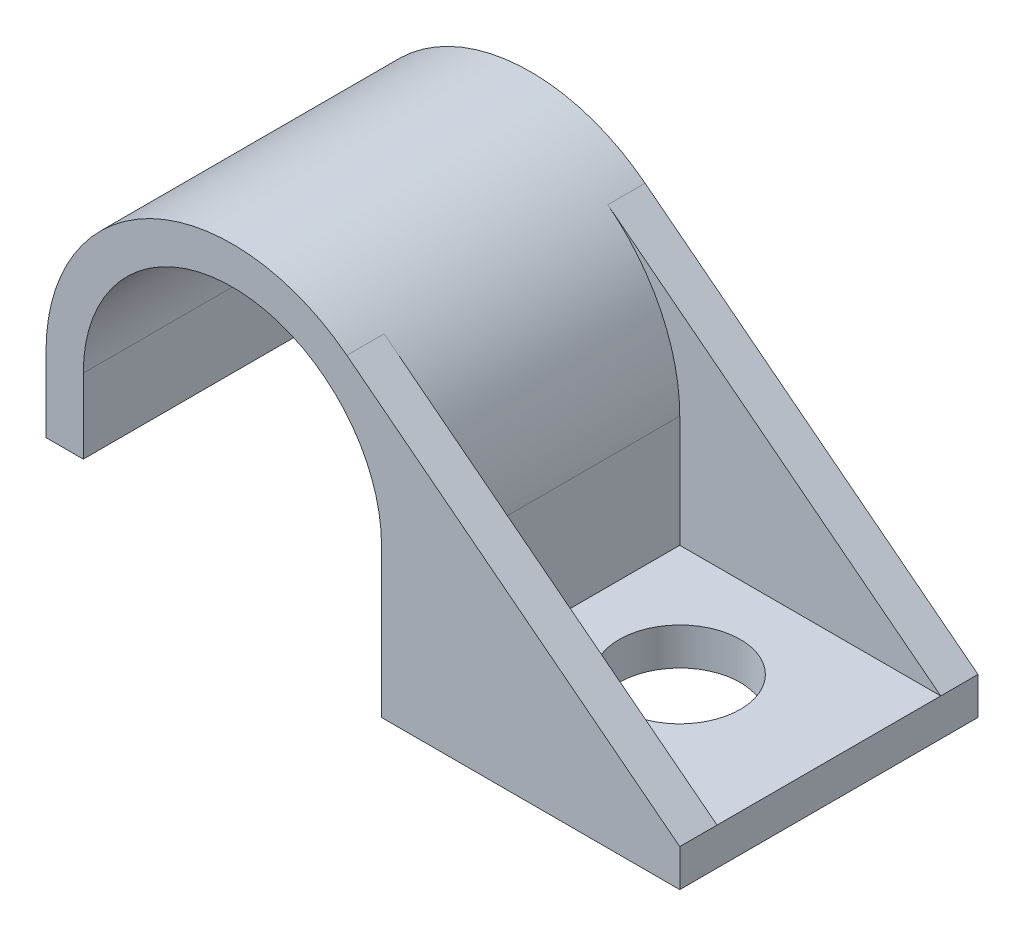
ISO-10303-21;
HEADER;
FILE_DESCRIPTION(('STEP AP214'),'2;1');
FILE_NAME('part.step','',(''),(''),'','','');
FILE_SCHEMA(('AUTOMOTIVE_DESIGN { 1 0 10303 214 1 1 1 1 }'));
ENDSEC;
DATA;
#1=APPLICATION_CONTEXT('core data for automotive mechanical design processes');
#2=APPLICATION_PROTOCOL_DEFINITION('international standard','automotive_design',2000,#1);
#3=PRODUCT_CONTEXT('',#1,'mechanical');
#4=PRODUCT('Part','Part','',(#3));
#5=PRODUCT_RELATED_PRODUCT_CATEGORY('part','',(#4));
#6=PRODUCT_DEFINITION_FORMATION('','',#4);
#7=PRODUCT_DEFINITION_CONTEXT('part definition',#1,'design');
#8=PRODUCT_DEFINITION('design','',#6,#7);
#9=PRODUCT_DEFINITION_SHAPE('','',#8);
#10=(LENGTH_UNIT() NAMED_UNIT(*) SI_UNIT(.MILLI.,.METRE.));
#11=(NAMED_UNIT(*) PLANE_ANGLE_UNIT() SI_UNIT($,.RADIAN.));
#12=(NAMED_UNIT(*) SI_UNIT($,.STERADIAN.) SOLID_ANGLE_UNIT());
#13=UNCERTAINTY_MEASURE_WITH_UNIT(LENGTH_MEASURE(1.E-05),#10,'distance_accuracy_value','');
#14=(GEOMETRIC_REPRESENTATION_CONTEXT(3) GLOBAL_UNCERTAINTY_ASSIGNED_CONTEXT((#13)) GLOBAL_UNIT_ASSIGNED_CONTEXT((#10,
#11,#12)) REPRESENTATION_CONTEXT('',''));
#15=CARTESIAN_POINT('',(0.,0.,0.));
#16=DIRECTION('',(0.,0.,1.));
#17=DIRECTION('',(1.,0.,0.));
#18=AXIS2_PLACEMENT_3D('',#15,#16,#17);
#19=CARTESIAN_POINT('',(6.35,0.,6.35));
#20=DIRECTION('',(0.,1.,0.));
#21=DIRECTION('',(-1.,0.,0.));
#22=AXIS2_PLACEMENT_3D('',#19,#20,#21);
#23=PLANE('',#22);
#24=DIRECTION('',(1.,0.,0.));
#25=VECTOR('',#24,1.);
#26=CARTESIAN_POINT('',(6.35,0.,-6.35));
#27=LINE('',#26,#25);
#28=CARTESIAN_POINT('',(6.35,0.,-6.35));
#29=VERTEX_POINT('',#28);
#30=CARTESIAN_POINT('',(19.05,0.,-6.35));
#31=VERTEX_POINT('',#30);
#32=EDGE_CURVE('E188',#29,#31,#27,.T.);
#33=ORIENTED_EDGE('',*,*,#32,.T.);
#34=DIRECTION('',(0.,0.,-1.));
#35=VECTOR('',#34,1.);
#36=CARTESIAN_POINT('',(19.05,0.,6.35));
#37=LINE('',#36,#35);
#38=CARTESIAN_POINT('',(19.05,0.,6.35));
#39=VERTEX_POINT('',#38);
#40=EDGE_CURVE('E162',#39,#31,#37,.T.);
#41=ORIENTED_EDGE('',*,*,#40,.F.);
#42=DIRECTION('',(1.,0.,0.));
#43=VECTOR('',#42,1.);
#44=CARTESIAN_POINT('',(6.35,0.,6.35));
#45=LINE('',#44,#43);
#46=CARTESIAN_POINT('',(6.35,0.,6.35));
#47=VERTEX_POINT('',#46);
#48=EDGE_CURVE('E238',#47,#39,#45,.T.);
#49=ORIENTED_EDGE('',*,*,#48,.F.);
#50=DIRECTION('',(0.,0.,-1.));
#51=VECTOR('',#50,1.);
#52=CARTESIAN_POINT('',(6.35,0.,6.35));
#53=LINE('',#52,#51);
#54=EDGE_CURVE('E165',#47,#29,#53,.T.);
#55=ORIENTED_EDGE('',*,*,#54,.T.);
#56=EDGE_LOOP('',(#33,#41,#49,#55));
#57=FACE_BOUND('',#56,.T.);
#58=CARTESIAN_POINT('',(12.7,0.,0.));
#59=DIRECTION('',(0.,1.,0.));
#60=DIRECTION('',(0.,0.,1.));
#61=AXIS2_PLACEMENT_3D('',#58,#59,#60);
#62=CIRCLE('',#61,2.5796875);
#63=CARTESIAN_POINT('',(12.7,0.,2.5796875));
#64=VERTEX_POINT('',#63);
#65=EDGE_CURVE('E253',#64,#64,#62,.T.);
#66=ORIENTED_EDGE('',*,*,#65,.T.);
#67=EDGE_LOOP('',(#66));
#68=FACE_BOUND('',#67,.T.);
#69=ADVANCED_FACE('F34',(#57,#68),#23,.F.);
#70=CARTESIAN_POINT('',(7.9375,1.5875,4.7625));
#71=DIRECTION('',(0.,1.,0.));
#72=DIRECTION('',(0.,0.,1.));
#73=AXIS2_PLACEMENT_3D('',#70,#71,#72);
#74=PLANE('',#73);
#75=DIRECTION('',(0.,0.,1.));
#76=VECTOR('',#75,1.);
#77=CARTESIAN_POINT('',(7.9375,1.5875,-4.7625));
#78=LINE('',#77,#76);
#79=CARTESIAN_POINT('',(7.9375,1.5875,-4.7625));
#80=VERTEX_POINT('',#79);
#81=CARTESIAN_POINT('',(7.9375,1.5875,4.7625));
#82=VERTEX_POINT('',#81);
#83=EDGE_CURVE('E247',#80,#82,#78,.T.);
#84=ORIENTED_EDGE('',*,*,#83,.T.);
#85=DIRECTION('',(1.,0.,0.));
#86=VECTOR('',#85,1.);
#87=CARTESIAN_POINT('',(7.9375,1.5875,4.7625));
#88=LINE('',#87,#86);
#89=CARTESIAN_POINT('',(19.05,1.5875,4.7625));
#90=VERTEX_POINT('',#89);
#91=EDGE_CURVE('E58',#82,#90,#88,.T.);
#92=ORIENTED_EDGE('',*,*,#91,.T.);
#93=DIRECTION('',(0.,0.,-1.));
#94=VECTOR('',#93,1.);
#95=CARTESIAN_POINT('',(19.05,1.5875,-4.7625));
#96=LINE('',#95,#94);
#97=CARTESIAN_POINT('',(19.05,1.5875,-4.7625));
#98=VERTEX_POINT('',#97);
#99=EDGE_CURVE('E244',#90,#98,#96,.T.);
#100=ORIENTED_EDGE('',*,*,#99,.T.);
#101=DIRECTION('',(-1.,0.,0.));
#102=VECTOR('',#101,1.);
#103=CARTESIAN_POINT('',(7.9375,1.5875,-4.7625));
#104=LINE('',#103,#102);
#105=EDGE_CURVE('E131',#98,#80,#104,.T.);
#106=ORIENTED_EDGE('',*,*,#105,.T.);
#107=EDGE_LOOP('',(#84,#92,#100,#106));
#108=FACE_BOUND('',#107,.T.);
#109=CARTESIAN_POINT('',(12.7,1.5875,0.));
#110=DIRECTION('',(0.,1.,0.));
#111=DIRECTION('',(0.,0.,1.));
#112=AXIS2_PLACEMENT_3D('',#109,#110,#111);
#113=CIRCLE('',#112,2.5796875);
#114=CARTESIAN_POINT('',(12.7,1.5875,2.5796875));
#115=VERTEX_POINT('',#114);
#116=EDGE_CURVE('E38',#115,#115,#113,.F.);
#117=ORIENTED_EDGE('',*,*,#116,.T.);
#118=EDGE_LOOP('',(#117));
#119=FACE_BOUND('',#118,.T.);
#120=ADVANCED_FACE('F260',(#108,#119),#74,.T.);
#121=CARTESIAN_POINT('',(19.05,1.5875,6.35));
#122=DIRECTION('',(-0.613994284293819,-0.789310470508608,0.));
#123=DIRECTION('',(0.789310470508608,-0.613994284293819,0.));
#124=AXIS2_PLACEMENT_3D('',#121,#122,#123);
#125=PLANE('',#124);
#126=DIRECTION('',(0.789310470508608,-0.613994284293819,0.));
#127=VECTOR('',#126,1.);
#128=CARTESIAN_POINT('',(19.05,1.5875,4.7625));
#129=LINE('',#128,#127);
#130=CARTESIAN_POINT('',(4.87357963158219,12.6151518596621,4.7625));
#131=VERTEX_POINT('',#130);
#132=EDGE_CURVE('E11',#131,#90,#129,.T.);
#133=ORIENTED_EDGE('',*,*,#132,.F.);
#134=DIRECTION('',(0.,0.,-1.));
#135=VECTOR('',#134,1.);
#136=CARTESIAN_POINT('',(4.87357963158219,12.6151518596621,6.35));
#137=LINE('',#136,#135);
#138=CARTESIAN_POINT('',(4.87357963158219,12.6151518596621,6.35));
#139=VERTEX_POINT('',#138);
#140=EDGE_CURVE('E149',#139,#131,#137,.T.);
#141=ORIENTED_EDGE('',*,*,#140,.F.);
#142=DIRECTION('',(-0.789310470508608,0.613994284293819,0.));
#143=VECTOR('',#142,1.);
#144=CARTESIAN_POINT('',(19.05,1.5875,6.35));
#145=LINE('',#144,#143);
#146=CARTESIAN_POINT('',(19.05,1.5875,6.35));
#147=VERTEX_POINT('',#146);
#148=EDGE_CURVE('E234',#147,#139,#145,.T.);
#149=ORIENTED_EDGE('',*,*,#148,.F.);
#150=DIRECTION('',(0.,0.,-1.));
#151=VECTOR('',#150,1.);
#152=CARTESIAN_POINT('',(19.05,1.5875,6.35));
#153=LINE('',#152,#151);
#154=EDGE_CURVE('E159',#147,#90,#153,.T.);
#155=ORIENTED_EDGE('',*,*,#154,.T.);
#156=EDGE_LOOP('',(#133,#141,#149,#155));
#157=FACE_BOUND('',#156,.T.);
#158=ADVANCED_FACE('F278',(#157),#125,.F.);
#159=CARTESIAN_POINT('',(4.87357963158219,12.6151518596621,-4.7625));
#160=VERTEX_POINT('',#159);
#161=CARTESIAN_POINT('',(4.87357963158219,12.6151518596621,-6.35));
#162=VERTEX_POINT('',#161);
#163=EDGE_CURVE('E139',#160,#162,#137,.T.);
#164=ORIENTED_EDGE('',*,*,#163,.F.);
#165=DIRECTION('',(-0.789310470508608,0.613994284293819,0.));
#166=VECTOR('',#165,1.);
#167=CARTESIAN_POINT('',(19.05,1.5875,-4.7625));
#168=LINE('',#167,#166);
#169=EDGE_CURVE('E43',#98,#160,#168,.T.);
#170=ORIENTED_EDGE('',*,*,#169,.F.);
#171=CARTESIAN_POINT('',(19.05,1.5875,-6.35));
#172=VERTEX_POINT('',#171);
#173=EDGE_CURVE('E153',#98,#172,#153,.T.);
#174=ORIENTED_EDGE('',*,*,#173,.T.);
#175=DIRECTION('',(-0.789310470508608,0.613994284293819,0.));
#176=VECTOR('',#175,1.);
#177=CARTESIAN_POINT('',(19.05,1.5875,-6.35));
#178=LINE('',#177,#176);
#179=EDGE_CURVE('E147',#172,#162,#178,.T.);
#180=ORIENTED_EDGE('',*,*,#179,.T.);
#181=EDGE_LOOP('',(#164,#170,#174,#180));
#182=FACE_BOUND('',#181,.T.);
#183=ADVANCED_FACE('F145',(#182),#125,.F.);
#184=CARTESIAN_POINT('',(0.,6.35,6.35));
#185=DIRECTION('',(0.,0.,-1.));
#186=DIRECTION('',(-1.,0.,0.));
#187=AXIS2_PLACEMENT_3D('',#184,#185,#186);
#188=CYLINDRICAL_SURFACE('',#187,6.35);
#189=CARTESIAN_POINT('',(0.,6.35,-6.35));
#190=DIRECTION('',(0.,0.,-1.));
#191=DIRECTION('',(1.,0.,0.));
#192=AXIS2_PLACEMENT_3D('',#189,#190,#191);
#193=CIRCLE('',#192,6.35);
#194=CARTESIAN_POINT('',(-6.35,6.35,-6.35));
#195=VERTEX_POINT('',#194);
#196=CARTESIAN_POINT('',(6.35,6.35,-6.35));
#197=VERTEX_POINT('',#196);
#198=EDGE_CURVE('E181',#195,#197,#193,.T.);
#199=ORIENTED_EDGE('',*,*,#198,.T.);
#200=DIRECTION('',(0.,0.,-1.));
#201=VECTOR('',#200,1.);
#202=CARTESIAN_POINT('',(6.35,6.35,6.35));
#203=LINE('',#202,#201);
#204=CARTESIAN_POINT('',(6.35,6.35,6.35));
#205=VERTEX_POINT('',#204);
#206=EDGE_CURVE('E135',#205,#197,#203,.T.);
#207=ORIENTED_EDGE('',*,*,#206,.F.);
#208=CARTESIAN_POINT('',(0.,6.35,6.35));
#209=DIRECTION('',(0.,0.,-1.));
#210=DIRECTION('',(1.,0.,0.));
#211=AXIS2_PLACEMENT_3D('',#208,#209,#210);
#212=CIRCLE('',#211,6.35);
#213=CARTESIAN_POINT('',(-6.35,6.35,6.35));
#214=VERTEX_POINT('',#213);
#215=EDGE_CURVE('E209',#214,#205,#212,.T.);
#216=ORIENTED_EDGE('',*,*,#215,.F.);
#217=DIRECTION('',(0.,0.,-1.));
#218=VECTOR('',#217,1.);
#219=CARTESIAN_POINT('',(-6.35,6.35,6.35));
#220=LINE('',#219,#218);
#221=EDGE_CURVE('E183',#214,#195,#220,.T.);
#222=ORIENTED_EDGE('',*,*,#221,.T.);
#223=EDGE_LOOP('',(#199,#207,#216,#222));
#224=FACE_BOUND('',#223,.T.);
#225=ADVANCED_FACE('F36',(#224),#188,.F.);
#226=CARTESIAN_POINT('',(6.35,6.35,6.35));
#227=DIRECTION('',(1.,0.,0.));
#228=DIRECTION('',(0.,1.,0.));
#229=AXIS2_PLACEMENT_3D('',#226,#227,#228);
#230=PLANE('',#229);
#231=DIRECTION('',(0.,-1.,0.));
#232=VECTOR('',#231,1.);
#233=CARTESIAN_POINT('',(6.35,6.35,-6.35));
#234=LINE('',#233,#232);
#235=EDGE_CURVE('E174',#197,#29,#234,.T.);
#236=ORIENTED_EDGE('',*,*,#235,.T.);
#237=ORIENTED_EDGE('',*,*,#54,.F.);
#238=DIRECTION('',(0.,-1.,0.));
#239=VECTOR('',#238,1.);
#240=CARTESIAN_POINT('',(6.35,6.35,6.35));
#241=LINE('',#240,#239);
#242=EDGE_CURVE('E175',#205,#47,#241,.T.);
#243=ORIENTED_EDGE('',*,*,#242,.F.);
#244=ORIENTED_EDGE('',*,*,#206,.T.);
#245=EDGE_LOOP('',(#236,#237,#243,#244));
#246=FACE_BOUND('',#245,.T.);
#247=ADVANCED_FACE('F172',(#246),#230,.F.);
#248=CARTESIAN_POINT('',(19.05,0.,6.35));
#249=DIRECTION('',(-1.,0.,0.));
#250=DIRECTION('',(0.,0.,1.));
#251=AXIS2_PLACEMENT_3D('',#248,#249,#250);
#252=PLANE('',#251);
#253=DIRECTION('',(0.,1.,0.));
#254=VECTOR('',#253,1.);
#255=CARTESIAN_POINT('',(19.05,0.,-6.35));
#256=LINE('',#255,#254);
#257=EDGE_CURVE('E197',#31,#172,#256,.T.);
#258=ORIENTED_EDGE('',*,*,#257,.T.);
#259=ORIENTED_EDGE('',*,*,#173,.F.);
#260=ORIENTED_EDGE('',*,*,#99,.F.);
#261=ORIENTED_EDGE('',*,*,#154,.F.);
#262=DIRECTION('',(0.,1.,0.));
#263=VECTOR('',#262,1.);
#264=CARTESIAN_POINT('',(19.05,0.,6.35));
#265=LINE('',#264,#263);
#266=EDGE_CURVE('E236',#39,#147,#265,.T.);
#267=ORIENTED_EDGE('',*,*,#266,.F.);
#268=ORIENTED_EDGE('',*,*,#40,.T.);
#269=EDGE_LOOP('',(#258,#259,#260,#261,#267,#268));
#270=FACE_BOUND('',#269,.T.);
#271=ADVANCED_FACE('F280',(#270),#252,.F.);
#272=CARTESIAN_POINT('',(0.,6.35,6.35));
#273=DIRECTION('',(0.,0.,-1.));
#274=DIRECTION('',(-1.,0.,0.));
#275=AXIS2_PLACEMENT_3D('',#272,#273,#274);
#276=CYLINDRICAL_SURFACE('',#275,7.9375);
#277=CARTESIAN_POINT('',(0.,6.35,-6.35));
#278=DIRECTION('',(0.,0.,1.));
#279=DIRECTION('',(-1.,0.,0.));
#280=AXIS2_PLACEMENT_3D('',#277,#278,#279);
#281=CIRCLE('',#280,7.9375);
#282=CARTESIAN_POINT('',(-7.9375,6.35,-6.35));
#283=VERTEX_POINT('',#282);
#284=EDGE_CURVE('E201',#162,#283,#281,.T.);
#285=ORIENTED_EDGE('',*,*,#284,.T.);
#286=DIRECTION('',(0.,0.,-1.));
#287=VECTOR('',#286,1.);
#288=CARTESIAN_POINT('',(-7.9375,6.35,6.35));
#289=LINE('',#288,#287);
#290=CARTESIAN_POINT('',(-7.9375,6.35,6.35));
#291=VERTEX_POINT('',#290);
#292=EDGE_CURVE('E150',#291,#283,#289,.T.);
#293=ORIENTED_EDGE('',*,*,#292,.F.);
#294=CARTESIAN_POINT('',(0.,6.35,6.35));
#295=DIRECTION('',(0.,0.,1.));
#296=DIRECTION('',(-1.,0.,0.));
#297=AXIS2_PLACEMENT_3D('',#294,#295,#296);
#298=CIRCLE('',#297,7.9375);
#299=EDGE_CURVE('E230',#139,#291,#298,.T.);
#300=ORIENTED_EDGE('',*,*,#299,.F.);
#301=ORIENTED_EDGE('',*,*,#140,.T.);
#302=CARTESIAN_POINT('',(0.,6.35,4.7625));
#303=DIRECTION('',(0.,0.,-1.));
#304=DIRECTION('',(-1.,0.,0.));
#305=AXIS2_PLACEMENT_3D('',#302,#303,#304);
#306=CIRCLE('',#305,7.9375);
#307=CARTESIAN_POINT('',(7.9375,6.35,4.7625));
#308=VERTEX_POINT('',#307);
#309=EDGE_CURVE('E249',#308,#131,#306,.F.);
#310=ORIENTED_EDGE('',*,*,#309,.F.);
#311=DIRECTION('',(0.,0.,-1.));
#312=VECTOR('',#311,1.);
#313=CARTESIAN_POINT('',(7.9375,6.35,11.7367193719894));
#314=LINE('',#313,#312);
#315=CARTESIAN_POINT('',(7.9375,6.35,-4.7625));
#316=VERTEX_POINT('',#315);
#317=EDGE_CURVE('E142',#308,#316,#314,.T.);
#318=ORIENTED_EDGE('',*,*,#317,.T.);
#319=CARTESIAN_POINT('',(0.,6.35,-4.7625));
#320=DIRECTION('',(0.,0.,1.));
#321=DIRECTION('',(1.,0.,0.));
#322=AXIS2_PLACEMENT_3D('',#319,#320,#321);
#323=CIRCLE('',#322,7.9375);
#324=EDGE_CURVE('E50',#316,#160,#323,.T.);
#325=ORIENTED_EDGE('',*,*,#324,.T.);
#326=ORIENTED_EDGE('',*,*,#163,.T.);
#327=EDGE_LOOP('',(#285,#293,#300,#301,#310,#318,#325,#326));
#328=FACE_BOUND('',#327,.T.);
#329=ADVANCED_FACE('F138',(#328),#276,.T.);
#330=CARTESIAN_POINT('',(-7.9375,3.175,6.35));
#331=DIRECTION('',(1.,0.,0.));
#332=DIRECTION('',(0.,0.,-1.));
#333=AXIS2_PLACEMENT_3D('',#330,#331,#332);
#334=PLANE('',#333);
#335=DIRECTION('',(0.,-1.,0.));
#336=VECTOR('',#335,1.);
#337=CARTESIAN_POINT('',(-7.9375,3.175,-6.35));
#338=LINE('',#337,#336);
#339=CARTESIAN_POINT('',(-7.9375,3.175,-6.35));
#340=VERTEX_POINT('',#339);
#341=EDGE_CURVE('E203',#283,#340,#338,.T.);
#342=ORIENTED_EDGE('',*,*,#341,.T.);
#343=DIRECTION('',(0.,0.,-1.));
#344=VECTOR('',#343,1.);
#345=CARTESIAN_POINT('',(-7.9375,3.175,6.35));
#346=LINE('',#345,#344);
#347=CARTESIAN_POINT('',(-7.9375,3.175,6.35));
#348=VERTEX_POINT('',#347);
#349=EDGE_CURVE('E155',#348,#340,#346,.T.);
#350=ORIENTED_EDGE('',*,*,#349,.F.);
#351=DIRECTION('',(0.,-1.,0.));
#352=VECTOR('',#351,1.);
#353=CARTESIAN_POINT('',(-7.9375,3.175,6.35));
#354=LINE('',#353,#352);
#355=EDGE_CURVE('E229',#291,#348,#354,.T.);
#356=ORIENTED_EDGE('',*,*,#355,.F.);
#357=ORIENTED_EDGE('',*,*,#292,.T.);
#358=EDGE_LOOP('',(#342,#350,#356,#357));
#359=FACE_BOUND('',#358,.T.);
#360=ADVANCED_FACE('F298',(#359),#334,.F.);
#361=CARTESIAN_POINT('',(-6.35,3.175,6.35));
#362=DIRECTION('',(0.,1.,0.));
#363=DIRECTION('',(-1.,0.,0.));
#364=AXIS2_PLACEMENT_3D('',#361,#362,#363);
#365=PLANE('',#364);
#366=DIRECTION('',(1.,0.,0.));
#367=VECTOR('',#366,1.);
#368=CARTESIAN_POINT('',(-6.35,3.175,-6.35));
#369=LINE('',#368,#367);
#370=CARTESIAN_POINT('',(-6.35,3.175,-6.35));
#371=VERTEX_POINT('',#370);
#372=EDGE_CURVE('E205',#340,#371,#369,.T.);
#373=ORIENTED_EDGE('',*,*,#372,.T.);
#374=DIRECTION('',(0.,0.,-1.));
#375=VECTOR('',#374,1.);
#376=CARTESIAN_POINT('',(-6.35,3.175,6.35));
#377=LINE('',#376,#375);
#378=CARTESIAN_POINT('',(-6.35,3.175,6.35));
#379=VERTEX_POINT('',#378);
#380=EDGE_CURVE('E211',#379,#371,#377,.T.);
#381=ORIENTED_EDGE('',*,*,#380,.F.);
#382=DIRECTION('',(1.,0.,0.));
#383=VECTOR('',#382,1.);
#384=CARTESIAN_POINT('',(-6.35,3.175,6.35));
#385=LINE('',#384,#383);
#386=EDGE_CURVE('E220',#348,#379,#385,.T.);
#387=ORIENTED_EDGE('',*,*,#386,.F.);
#388=ORIENTED_EDGE('',*,*,#349,.T.);
#389=EDGE_LOOP('',(#373,#381,#387,#388));
#390=FACE_BOUND('',#389,.T.);
#391=ADVANCED_FACE('F218',(#390),#365,.F.);
#392=CARTESIAN_POINT('',(-6.35,6.35,6.35));
#393=DIRECTION('',(-1.,0.,0.));
#394=DIRECTION('',(0.,0.,1.));
#395=AXIS2_PLACEMENT_3D('',#392,#393,#394);
#396=PLANE('',#395);
#397=DIRECTION('',(0.,1.,0.));
#398=VECTOR('',#397,1.);
#399=CARTESIAN_POINT('',(-6.35,6.35,-6.35));
#400=LINE('',#399,#398);
#401=EDGE_CURVE('E207',#371,#195,#400,.T.);
#402=ORIENTED_EDGE('',*,*,#401,.T.);
#403=ORIENTED_EDGE('',*,*,#221,.F.);
#404=DIRECTION('',(0.,1.,0.));
#405=VECTOR('',#404,1.);
#406=CARTESIAN_POINT('',(-6.35,6.35,6.35));
#407=LINE('',#406,#405);
#408=EDGE_CURVE('E193',#379,#214,#407,.T.);
#409=ORIENTED_EDGE('',*,*,#408,.F.);
#410=ORIENTED_EDGE('',*,*,#380,.T.);
#411=EDGE_LOOP('',(#402,#403,#409,#410));
#412=FACE_BOUND('',#411,.T.);
#413=ADVANCED_FACE('F226',(#412),#396,.F.);
#414=CARTESIAN_POINT('',(0.,6.35,6.35));
#415=DIRECTION('',(0.,0.,1.));
#416=DIRECTION('',(1.,0.,0.));
#417=AXIS2_PLACEMENT_3D('',#414,#415,#416);
#418=PLANE('',#417);
#419=ORIENTED_EDGE('',*,*,#215,.T.);
#420=ORIENTED_EDGE('',*,*,#242,.T.);
#421=ORIENTED_EDGE('',*,*,#48,.T.);
#422=ORIENTED_EDGE('',*,*,#266,.T.);
#423=ORIENTED_EDGE('',*,*,#148,.T.);
#424=ORIENTED_EDGE('',*,*,#299,.T.);
#425=ORIENTED_EDGE('',*,*,#355,.T.);
#426=ORIENTED_EDGE('',*,*,#386,.T.);
#427=ORIENTED_EDGE('',*,*,#408,.T.);
#428=EDGE_LOOP('',(#419,#420,#421,#422,#423,#424,#425,#426,#427));
#429=FACE_BOUND('',#428,.T.);
#430=ADVANCED_FACE('F305',(#429),#418,.T.);
#431=CARTESIAN_POINT('',(0.,6.35,-6.35));
#432=DIRECTION('',(0.,0.,1.));
#433=DIRECTION('',(1.,0.,0.));
#434=AXIS2_PLACEMENT_3D('',#431,#432,#433);
#435=PLANE('',#434);
#436=ORIENTED_EDGE('',*,*,#198,.F.);
#437=ORIENTED_EDGE('',*,*,#401,.F.);
#438=ORIENTED_EDGE('',*,*,#372,.F.);
#439=ORIENTED_EDGE('',*,*,#341,.F.);
#440=ORIENTED_EDGE('',*,*,#284,.F.);
#441=ORIENTED_EDGE('',*,*,#179,.F.);
#442=ORIENTED_EDGE('',*,*,#257,.F.);
#443=ORIENTED_EDGE('',*,*,#32,.F.);
#444=ORIENTED_EDGE('',*,*,#235,.F.);
#445=EDGE_LOOP('',(#436,#437,#438,#439,#440,#441,#442,#443,#444));
#446=FACE_BOUND('',#445,.T.);
#447=ADVANCED_FACE('F224',(#446),#435,.F.);
#448=CARTESIAN_POINT('',(7.9375,14.2875,-4.7625));
#449=DIRECTION('',(1.,0.,0.));
#450=DIRECTION('',(0.,0.,-1.));
#451=AXIS2_PLACEMENT_3D('',#448,#449,#450);
#452=PLANE('',#451);
#453=ORIENTED_EDGE('',*,*,#317,.F.);
#454=DIRECTION('',(0.,-1.,0.));
#455=VECTOR('',#454,1.);
#456=CARTESIAN_POINT('',(7.9375,14.2875,4.7625));
#457=LINE('',#456,#455);
#458=EDGE_CURVE('E186',#308,#82,#457,.T.);
#459=ORIENTED_EDGE('',*,*,#458,.T.);
#460=ORIENTED_EDGE('',*,*,#83,.F.);
#461=DIRECTION('',(0.,-1.,0.));
#462=VECTOR('',#461,1.);
#463=CARTESIAN_POINT('',(7.9375,14.2875,-4.7625));
#464=LINE('',#463,#462);
#465=EDGE_CURVE('E190',#316,#80,#464,.T.);
#466=ORIENTED_EDGE('',*,*,#465,.F.);
#467=EDGE_LOOP('',(#453,#459,#460,#466));
#468=FACE_BOUND('',#467,.T.);
#469=ADVANCED_FACE('F308',(#468),#452,.T.);
#470=CARTESIAN_POINT('',(7.9375,14.2875,4.7625));
#471=DIRECTION('',(0.,0.,-1.));
#472=DIRECTION('',(-1.,0.,0.));
#473=AXIS2_PLACEMENT_3D('',#470,#471,#472);
#474=PLANE('',#473);
#475=ORIENTED_EDGE('',*,*,#132,.T.);
#476=ORIENTED_EDGE('',*,*,#91,.F.);
#477=ORIENTED_EDGE('',*,*,#458,.F.);
#478=ORIENTED_EDGE('',*,*,#309,.T.);
#479=EDGE_LOOP('',(#475,#476,#477,#478));
#480=FACE_BOUND('',#479,.T.);
#481=ADVANCED_FACE('F269',(#480),#474,.T.);
#482=CARTESIAN_POINT('',(7.9375,14.2875,-4.7625));
#483=DIRECTION('',(0.,0.,1.));
#484=DIRECTION('',(1.,0.,0.));
#485=AXIS2_PLACEMENT_3D('',#482,#483,#484);
#486=PLANE('',#485);
#487=ORIENTED_EDGE('',*,*,#169,.T.);
#488=ORIENTED_EDGE('',*,*,#324,.F.);
#489=ORIENTED_EDGE('',*,*,#465,.T.);
#490=ORIENTED_EDGE('',*,*,#105,.F.);
#491=EDGE_LOOP('',(#487,#488,#489,#490));
#492=FACE_BOUND('',#491,.T.);
#493=ADVANCED_FACE('F129',(#492),#486,.T.);
#494=CARTESIAN_POINT('',(12.7,2.54,0.));
#495=DIRECTION('',(0.,-1.,0.));
#496=DIRECTION('',(0.,0.,-1.));
#497=AXIS2_PLACEMENT_3D('',#494,#495,#496);
#498=CYLINDRICAL_SURFACE('',#497,2.5796875);
#499=ORIENTED_EDGE('',*,*,#116,.F.);
#500=EDGE_LOOP('',(#499));
#501=FACE_BOUND('',#500,.T.);
#502=ORIENTED_EDGE('',*,*,#65,.F.);
#503=EDGE_LOOP('',(#502));
#504=FACE_BOUND('',#503,.T.);
#505=ADVANCED_FACE('F262',(#501,#504),#498,.F.);
#506=CLOSED_SHELL('',(#69,#120,#158,#183,#225,#247,#271,#329,#360,#391,#413,#430,#447,#469,#481,
#493,#505));
#507=MANIFOLD_SOLID_BREP('B2',#506);
#508=ADVANCED_BREP_SHAPE_REPRESENTATION('',(#18,#507),#14);
#509=SHAPE_DEFINITION_REPRESENTATION(#9,#508);
ENDSEC;
END-ISO-10303-21;
